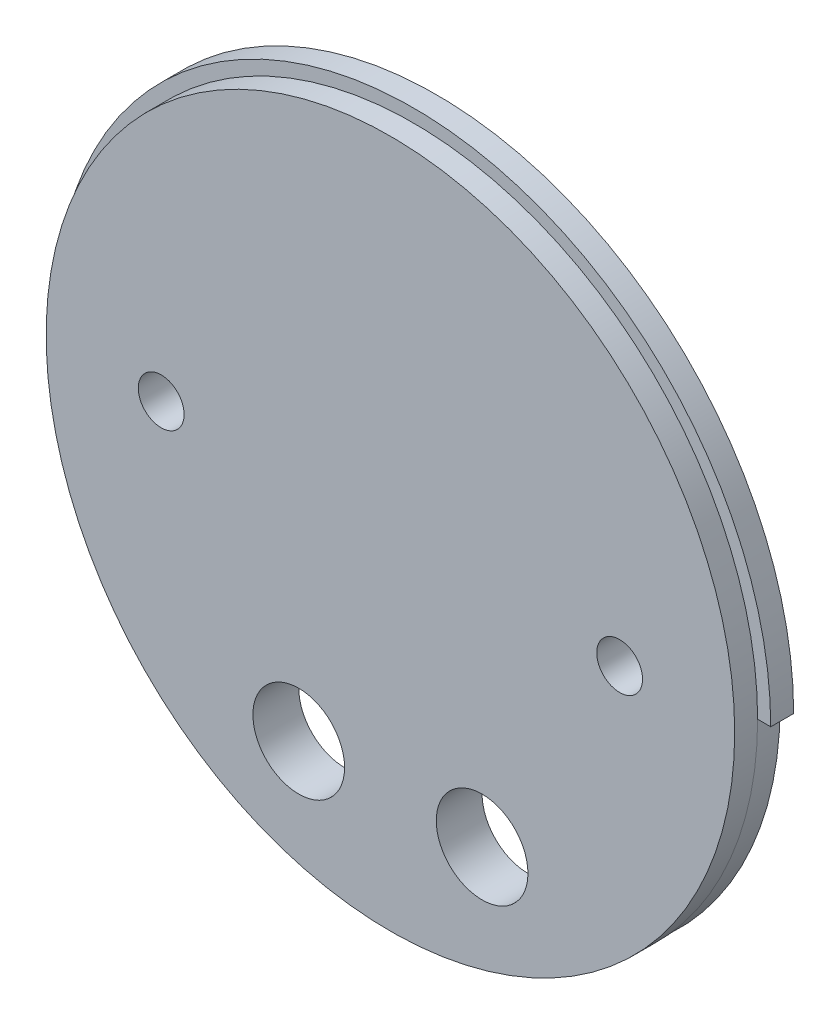
ISO-10303-21;
HEADER;
FILE_DESCRIPTION(('STEP AP214'),'2;1');
FILE_NAME('part.step','',(''),(''),'','','');
FILE_SCHEMA(('AUTOMOTIVE_DESIGN { 1 0 10303 214 1 1 1 1 }'));
ENDSEC;
DATA;
#1=APPLICATION_CONTEXT('core data for automotive mechanical design processes');
#2=APPLICATION_PROTOCOL_DEFINITION('international standard','automotive_design',2000,#1);
#3=PRODUCT_CONTEXT('',#1,'mechanical');
#4=PRODUCT('Part','Part','',(#3));
#5=PRODUCT_RELATED_PRODUCT_CATEGORY('part','',(#4));
#6=PRODUCT_DEFINITION_FORMATION('','',#4);
#7=PRODUCT_DEFINITION_CONTEXT('part definition',#1,'design');
#8=PRODUCT_DEFINITION('design','',#6,#7);
#9=PRODUCT_DEFINITION_SHAPE('','',#8);
#10=(LENGTH_UNIT() NAMED_UNIT(*) SI_UNIT(.MILLI.,.METRE.));
#11=(NAMED_UNIT(*) PLANE_ANGLE_UNIT() SI_UNIT($,.RADIAN.));
#12=(NAMED_UNIT(*) SI_UNIT($,.STERADIAN.) SOLID_ANGLE_UNIT());
#13=UNCERTAINTY_MEASURE_WITH_UNIT(LENGTH_MEASURE(1.E-05),#10,'distance_accuracy_value','');
#14=(GEOMETRIC_REPRESENTATION_CONTEXT(3) GLOBAL_UNCERTAINTY_ASSIGNED_CONTEXT((#13)) GLOBAL_UNIT_ASSIGNED_CONTEXT((#10,
#11,#12)) REPRESENTATION_CONTEXT('',''));
#15=CARTESIAN_POINT('',(0.,0.,0.));
#16=DIRECTION('',(0.,0.,1.));
#17=DIRECTION('',(1.,0.,0.));
#18=AXIS2_PLACEMENT_3D('',#15,#16,#17);
#19=CARTESIAN_POINT('',(0.,0.,3.175));
#20=DIRECTION('',(0.,0.,-1.));
#21=DIRECTION('',(-1.,0.,0.));
#22=AXIS2_PLACEMENT_3D('',#19,#20,#21);
#23=CYLINDRICAL_SURFACE('',#22,49.5046);
#24=CARTESIAN_POINT('',(0.,0.,3.175));
#25=DIRECTION('',(0.,0.,1.));
#26=DIRECTION('',(1.,0.,0.));
#27=AXIS2_PLACEMENT_3D('',#24,#25,#26);
#28=CIRCLE('',#27,49.5046);
#29=CARTESIAN_POINT('',(49.5046,0.,3.175));
#30=VERTEX_POINT('',#29);
#31=CARTESIAN_POINT('',(-49.5046,0.,3.175));
#32=VERTEX_POINT('',#31);
#33=EDGE_CURVE('E146',#30,#32,#28,.T.);
#34=ORIENTED_EDGE('',*,*,#33,.F.);
#35=DIRECTION('',(0.,0.,-1.));
#36=VECTOR('',#35,1.);
#37=CARTESIAN_POINT('',(49.5046,0.,3.175));
#38=LINE('',#37,#36);
#39=CARTESIAN_POINT('',(49.5046,0.,0.));
#40=VERTEX_POINT('',#39);
#41=EDGE_CURVE('E113',#30,#40,#38,.T.);
#42=ORIENTED_EDGE('',*,*,#41,.T.);
#43=CARTESIAN_POINT('',(0.,0.,0.));
#44=DIRECTION('',(0.,0.,1.));
#45=DIRECTION('',(1.,0.,0.));
#46=AXIS2_PLACEMENT_3D('',#43,#44,#45);
#47=CIRCLE('',#46,49.5046);
#48=CARTESIAN_POINT('',(-49.5046,0.,0.));
#49=VERTEX_POINT('',#48);
#50=EDGE_CURVE('E142',#40,#49,#47,.T.);
#51=ORIENTED_EDGE('',*,*,#50,.T.);
#52=DIRECTION('',(0.,0.,-1.));
#53=VECTOR('',#52,1.);
#54=CARTESIAN_POINT('',(-49.5046,0.,3.175));
#55=LINE('',#54,#53);
#56=EDGE_CURVE('E97',#49,#32,#55,.F.);
#57=ORIENTED_EDGE('',*,*,#56,.T.);
#58=EDGE_LOOP('',(#34,#42,#51,#57));
#59=FACE_BOUND('',#58,.T.);
#60=ADVANCED_FACE('F37',(#59),#23,.T.);
#61=CARTESIAN_POINT('',(0.,0.,3.175));
#62=DIRECTION('',(0.,0.,1.));
#63=DIRECTION('',(1.,0.,0.));
#64=AXIS2_PLACEMENT_3D('',#61,#62,#63);
#65=PLANE('',#64);
#66=DIRECTION('',(-1.,0.,0.));
#67=VECTOR('',#66,1.);
#68=CARTESIAN_POINT('',(47.625,0.,3.175));
#69=LINE('',#68,#67);
#70=CARTESIAN_POINT('',(47.6885,0.,3.175));
#71=VERTEX_POINT('',#70);
#72=EDGE_CURVE('E51',#30,#71,#69,.T.);
#73=ORIENTED_EDGE('',*,*,#72,.F.);
#74=ORIENTED_EDGE('',*,*,#33,.T.);
#75=DIRECTION('',(-1.,0.,0.));
#76=VECTOR('',#75,1.);
#77=CARTESIAN_POINT('',(-50.165,0.,3.175));
#78=LINE('',#77,#76);
#79=CARTESIAN_POINT('',(-47.6885,0.,3.175));
#80=VERTEX_POINT('',#79);
#81=EDGE_CURVE('E108',#80,#32,#78,.T.);
#82=ORIENTED_EDGE('',*,*,#81,.F.);
#83=CARTESIAN_POINT('',(0.,0.,3.175));
#84=DIRECTION('',(0.,0.,1.));
#85=DIRECTION('',(1.,0.,0.));
#86=AXIS2_PLACEMENT_3D('',#83,#84,#85);
#87=CIRCLE('',#86,47.6885);
#88=EDGE_CURVE('E44',#71,#80,#87,.T.);
#89=ORIENTED_EDGE('',*,*,#88,.F.);
#90=EDGE_LOOP('',(#73,#74,#82,#89));
#91=FACE_BOUND('',#90,.T.);
#92=ADVANCED_FACE('F153',(#91),#65,.T.);
#93=CARTESIAN_POINT('',(0.,0.,0.));
#94=DIRECTION('',(0.,0.,1.));
#95=DIRECTION('',(1.,0.,0.));
#96=AXIS2_PLACEMENT_3D('',#93,#94,#95);
#97=PLANE('',#96);
#98=CARTESIAN_POINT('',(-31.75,0.,0.));
#99=DIRECTION('',(0.,0.,1.));
#100=DIRECTION('',(1.,0.,0.));
#101=AXIS2_PLACEMENT_3D('',#98,#99,#100);
#102=CIRCLE('',#101,3.17500000000001);
#103=CARTESIAN_POINT('',(-28.575,0.,0.));
#104=VERTEX_POINT('',#103);
#105=EDGE_CURVE('E116',#104,#104,#102,.T.);
#106=ORIENTED_EDGE('',*,*,#105,.T.);
#107=EDGE_LOOP('',(#106));
#108=FACE_BOUND('',#107,.T.);
#109=CARTESIAN_POINT('',(12.7,-31.2353524431853,0.));
#110=DIRECTION('',(0.,0.,1.));
#111=DIRECTION('',(1.,0.,0.));
#112=AXIS2_PLACEMENT_3D('',#109,#110,#111);
#113=CIRCLE('',#112,6.35);
#114=CARTESIAN_POINT('',(19.05,-31.2353524431853,0.));
#115=VERTEX_POINT('',#114);
#116=EDGE_CURVE('E124',#115,#115,#113,.T.);
#117=ORIENTED_EDGE('',*,*,#116,.T.);
#118=EDGE_LOOP('',(#117));
#119=FACE_BOUND('',#118,.T.);
#120=CARTESIAN_POINT('',(-12.7,-31.2353524431853,0.));
#121=DIRECTION('',(0.,0.,1.));
#122=DIRECTION('',(1.,0.,0.));
#123=AXIS2_PLACEMENT_3D('',#120,#121,#122);
#124=CIRCLE('',#123,6.35);
#125=CARTESIAN_POINT('',(-6.35,-31.2353524431853,0.));
#126=VERTEX_POINT('',#125);
#127=EDGE_CURVE('E135',#126,#126,#124,.T.);
#128=ORIENTED_EDGE('',*,*,#127,.T.);
#129=EDGE_LOOP('',(#128));
#130=FACE_BOUND('',#129,.T.);
#131=CARTESIAN_POINT('',(31.75,0.,0.));
#132=DIRECTION('',(0.,0.,1.));
#133=DIRECTION('',(1.,0.,0.));
#134=AXIS2_PLACEMENT_3D('',#131,#132,#133);
#135=CIRCLE('',#134,3.17500000000001);
#136=CARTESIAN_POINT('',(34.925,0.,0.));
#137=VERTEX_POINT('',#136);
#138=EDGE_CURVE('E123',#137,#137,#135,.T.);
#139=ORIENTED_EDGE('',*,*,#138,.T.);
#140=EDGE_LOOP('',(#139));
#141=FACE_BOUND('',#140,.T.);
#142=ORIENTED_EDGE('',*,*,#50,.F.);
#143=DIRECTION('',(-1.,0.,0.));
#144=VECTOR('',#143,1.);
#145=CARTESIAN_POINT('',(0.,0.,0.));
#146=LINE('',#145,#144);
#147=CARTESIAN_POINT('',(47.625,0.,0.));
#148=VERTEX_POINT('',#147);
#149=EDGE_CURVE('E11',#40,#148,#146,.T.);
#150=ORIENTED_EDGE('',*,*,#149,.T.);
#151=CARTESIAN_POINT('',(0.,0.,0.));
#152=DIRECTION('',(0.,0.,-1.));
#153=DIRECTION('',(1.,0.,0.));
#154=AXIS2_PLACEMENT_3D('',#151,#152,#153);
#155=CIRCLE('',#154,47.625);
#156=CARTESIAN_POINT('',(-47.625,0.,0.));
#157=VERTEX_POINT('',#156);
#158=EDGE_CURVE('E85',#148,#157,#155,.T.);
#159=ORIENTED_EDGE('',*,*,#158,.T.);
#160=DIRECTION('',(-1.,0.,0.));
#161=VECTOR('',#160,1.);
#162=CARTESIAN_POINT('',(-50.165,0.,0.));
#163=LINE('',#162,#161);
#164=EDGE_CURVE('E92',#157,#49,#163,.T.);
#165=ORIENTED_EDGE('',*,*,#164,.T.);
#166=EDGE_LOOP('',(#142,#150,#159,#165));
#167=FACE_BOUND('',#166,.T.);
#168=ADVANCED_FACE('F102',(#108,#119,#130,#141,#167),#97,.F.);
#169=CARTESIAN_POINT('',(0.,0.,6.35));
#170=DIRECTION('',(0.,0.,-1.));
#171=DIRECTION('',(-1.,0.,0.));
#172=AXIS2_PLACEMENT_3D('',#169,#170,#171);
#173=CYLINDRICAL_SURFACE('',#172,47.6885);
#174=CARTESIAN_POINT('',(0.,0.,6.35));
#175=DIRECTION('',(0.,0.,1.));
#176=DIRECTION('',(1.,0.,0.));
#177=AXIS2_PLACEMENT_3D('',#174,#175,#176);
#178=CIRCLE('',#177,47.6885);
#179=CARTESIAN_POINT('',(47.6885,0.,6.35));
#180=VERTEX_POINT('',#179);
#181=EDGE_CURVE('E119',#180,#180,#178,.T.);
#182=ORIENTED_EDGE('',*,*,#181,.F.);
#183=EDGE_LOOP('',(#182));
#184=FACE_BOUND('',#183,.T.);
#185=ORIENTED_EDGE('',*,*,#88,.T.);
#186=EDGE_CURVE('E145',#80,#71,#87,.T.);
#187=ORIENTED_EDGE('',*,*,#186,.T.);
#188=EDGE_LOOP('',(#185,#187));
#189=FACE_BOUND('',#188,.T.);
#190=ADVANCED_FACE('F157',(#184,#189),#173,.T.);
#191=CARTESIAN_POINT('',(0.,0.,6.35));
#192=DIRECTION('',(0.,0.,1.));
#193=DIRECTION('',(1.,0.,0.));
#194=AXIS2_PLACEMENT_3D('',#191,#192,#193);
#195=PLANE('',#194);
#196=CARTESIAN_POINT('',(-31.75,0.,6.35));
#197=DIRECTION('',(0.,0.,1.));
#198=DIRECTION('',(1.,0.,0.));
#199=AXIS2_PLACEMENT_3D('',#196,#197,#198);
#200=CIRCLE('',#199,3.17500000000001);
#201=CARTESIAN_POINT('',(-28.575,0.,6.35));
#202=VERTEX_POINT('',#201);
#203=EDGE_CURVE('E120',#202,#202,#200,.T.);
#204=ORIENTED_EDGE('',*,*,#203,.F.);
#205=EDGE_LOOP('',(#204));
#206=FACE_BOUND('',#205,.T.);
#207=CARTESIAN_POINT('',(12.7,-31.2353524431853,6.35));
#208=DIRECTION('',(0.,0.,1.));
#209=DIRECTION('',(1.,0.,0.));
#210=AXIS2_PLACEMENT_3D('',#207,#208,#209);
#211=CIRCLE('',#210,6.35);
#212=CARTESIAN_POINT('',(19.05,-31.2353524431853,6.35));
#213=VERTEX_POINT('',#212);
#214=EDGE_CURVE('E115',#213,#213,#211,.T.);
#215=ORIENTED_EDGE('',*,*,#214,.F.);
#216=EDGE_LOOP('',(#215));
#217=FACE_BOUND('',#216,.T.);
#218=CARTESIAN_POINT('',(-12.7,-31.2353524431853,6.35));
#219=DIRECTION('',(0.,0.,1.));
#220=DIRECTION('',(1.,0.,0.));
#221=AXIS2_PLACEMENT_3D('',#218,#219,#220);
#222=CIRCLE('',#221,6.35);
#223=CARTESIAN_POINT('',(-6.35,-31.2353524431853,6.35));
#224=VERTEX_POINT('',#223);
#225=EDGE_CURVE('E127',#224,#224,#222,.T.);
#226=ORIENTED_EDGE('',*,*,#225,.F.);
#227=EDGE_LOOP('',(#226));
#228=FACE_BOUND('',#227,.T.);
#229=CARTESIAN_POINT('',(31.75,0.,6.35));
#230=DIRECTION('',(0.,0.,1.));
#231=DIRECTION('',(1.,0.,0.));
#232=AXIS2_PLACEMENT_3D('',#229,#230,#231);
#233=CIRCLE('',#232,3.17500000000001);
#234=CARTESIAN_POINT('',(34.925,0.,6.35));
#235=VERTEX_POINT('',#234);
#236=EDGE_CURVE('E132',#235,#235,#233,.T.);
#237=ORIENTED_EDGE('',*,*,#236,.F.);
#238=EDGE_LOOP('',(#237));
#239=FACE_BOUND('',#238,.T.);
#240=ORIENTED_EDGE('',*,*,#181,.T.);
#241=EDGE_LOOP('',(#240));
#242=FACE_BOUND('',#241,.T.);
#243=ADVANCED_FACE('F181',(#206,#217,#228,#239,#242),#195,.T.);
#244=CARTESIAN_POINT('',(31.75,0.,0.));
#245=DIRECTION('',(0.,0.,1.));
#246=DIRECTION('',(1.,0.,0.));
#247=AXIS2_PLACEMENT_3D('',#244,#245,#246);
#248=CYLINDRICAL_SURFACE('',#247,3.17500000000001);
#249=ORIENTED_EDGE('',*,*,#138,.F.);
#250=EDGE_LOOP('',(#249));
#251=FACE_BOUND('',#250,.T.);
#252=ORIENTED_EDGE('',*,*,#236,.T.);
#253=EDGE_LOOP('',(#252));
#254=FACE_BOUND('',#253,.T.);
#255=ADVANCED_FACE('F185',(#251,#254),#248,.F.);
#256=CARTESIAN_POINT('',(-12.7,-31.2353524431853,0.));
#257=DIRECTION('',(0.,0.,1.));
#258=DIRECTION('',(1.,0.,0.));
#259=AXIS2_PLACEMENT_3D('',#256,#257,#258);
#260=CYLINDRICAL_SURFACE('',#259,6.35);
#261=ORIENTED_EDGE('',*,*,#127,.F.);
#262=EDGE_LOOP('',(#261));
#263=FACE_BOUND('',#262,.T.);
#264=ORIENTED_EDGE('',*,*,#225,.T.);
#265=EDGE_LOOP('',(#264));
#266=FACE_BOUND('',#265,.T.);
#267=ADVANCED_FACE('F187',(#263,#266),#260,.F.);
#268=CARTESIAN_POINT('',(12.7,-31.2353524431853,0.));
#269=DIRECTION('',(0.,0.,1.));
#270=DIRECTION('',(1.,0.,0.));
#271=AXIS2_PLACEMENT_3D('',#268,#269,#270);
#272=CYLINDRICAL_SURFACE('',#271,6.35);
#273=ORIENTED_EDGE('',*,*,#116,.F.);
#274=EDGE_LOOP('',(#273));
#275=FACE_BOUND('',#274,.T.);
#276=ORIENTED_EDGE('',*,*,#214,.T.);
#277=EDGE_LOOP('',(#276));
#278=FACE_BOUND('',#277,.T.);
#279=ADVANCED_FACE('F190',(#275,#278),#272,.F.);
#280=CARTESIAN_POINT('',(-31.75,0.,0.));
#281=DIRECTION('',(0.,0.,1.));
#282=DIRECTION('',(1.,0.,0.));
#283=AXIS2_PLACEMENT_3D('',#280,#281,#282);
#284=CYLINDRICAL_SURFACE('',#283,3.17500000000001);
#285=ORIENTED_EDGE('',*,*,#105,.F.);
#286=EDGE_LOOP('',(#285));
#287=FACE_BOUND('',#286,.T.);
#288=ORIENTED_EDGE('',*,*,#203,.T.);
#289=EDGE_LOOP('',(#288));
#290=FACE_BOUND('',#289,.T.);
#291=ADVANCED_FACE('F197',(#287,#290),#284,.F.);
#292=CARTESIAN_POINT('',(47.625,0.,0.));
#293=DIRECTION('',(0.,1.,0.));
#294=DIRECTION('',(0.,0.,1.));
#295=AXIS2_PLACEMENT_3D('',#292,#293,#294);
#296=PLANE('',#295);
#297=ORIENTED_EDGE('',*,*,#72,.T.);
#298=CARTESIAN_POINT('',(47.625,0.,3.175));
#299=VERTEX_POINT('',#298);
#300=EDGE_CURVE('E104',#71,#299,#69,.T.);
#301=ORIENTED_EDGE('',*,*,#300,.T.);
#302=DIRECTION('',(0.,0.,1.));
#303=VECTOR('',#302,1.);
#304=CARTESIAN_POINT('',(47.625,0.,0.));
#305=LINE('',#304,#303);
#306=EDGE_CURVE('E91',#148,#299,#305,.T.);
#307=ORIENTED_EDGE('',*,*,#306,.F.);
#308=ORIENTED_EDGE('',*,*,#149,.F.);
#309=ORIENTED_EDGE('',*,*,#41,.F.);
#310=EDGE_LOOP('',(#297,#301,#307,#308,#309));
#311=FACE_BOUND('',#310,.T.);
#312=ADVANCED_FACE('F150',(#311),#296,.F.);
#313=CARTESIAN_POINT('',(-50.165,0.,0.));
#314=DIRECTION('',(0.,1.,0.));
#315=DIRECTION('',(0.,0.,1.));
#316=AXIS2_PLACEMENT_3D('',#313,#314,#315);
#317=PLANE('',#316);
#318=ORIENTED_EDGE('',*,*,#164,.F.);
#319=DIRECTION('',(0.,0.,1.));
#320=VECTOR('',#319,1.);
#321=CARTESIAN_POINT('',(-47.625,0.,0.));
#322=LINE('',#321,#320);
#323=CARTESIAN_POINT('',(-47.625,0.,3.175));
#324=VERTEX_POINT('',#323);
#325=EDGE_CURVE('E80',#157,#324,#322,.T.);
#326=ORIENTED_EDGE('',*,*,#325,.T.);
#327=EDGE_CURVE('E109',#324,#80,#78,.T.);
#328=ORIENTED_EDGE('',*,*,#327,.T.);
#329=ORIENTED_EDGE('',*,*,#81,.T.);
#330=ORIENTED_EDGE('',*,*,#56,.F.);
#331=EDGE_LOOP('',(#318,#326,#328,#329,#330));
#332=FACE_BOUND('',#331,.T.);
#333=ADVANCED_FACE('F95',(#332),#317,.F.);
#334=CARTESIAN_POINT('',(0.,0.,3.175));
#335=DIRECTION('',(0.,0.,1.));
#336=DIRECTION('',(1.,0.,0.));
#337=AXIS2_PLACEMENT_3D('',#334,#335,#336);
#338=PLANE('',#337);
#339=ORIENTED_EDGE('',*,*,#327,.F.);
#340=CARTESIAN_POINT('',(0.,0.,3.175));
#341=DIRECTION('',(0.,0.,-1.));
#342=DIRECTION('',(1.,0.,0.));
#343=AXIS2_PLACEMENT_3D('',#340,#341,#342);
#344=CIRCLE('',#343,47.625);
#345=EDGE_CURVE('E87',#299,#324,#344,.T.);
#346=ORIENTED_EDGE('',*,*,#345,.F.);
#347=ORIENTED_EDGE('',*,*,#300,.F.);
#348=ORIENTED_EDGE('',*,*,#186,.F.);
#349=EDGE_LOOP('',(#339,#346,#347,#348));
#350=FACE_BOUND('',#349,.T.);
#351=ADVANCED_FACE('F159',(#350),#338,.F.);
#352=CARTESIAN_POINT('',(0.,0.,0.));
#353=DIRECTION('',(0.,0.,1.));
#354=DIRECTION('',(1.,0.,0.));
#355=AXIS2_PLACEMENT_3D('',#352,#353,#354);
#356=CYLINDRICAL_SURFACE('',#355,47.625);
#357=ORIENTED_EDGE('',*,*,#345,.T.);
#358=ORIENTED_EDGE('',*,*,#325,.F.);
#359=ORIENTED_EDGE('',*,*,#158,.F.);
#360=ORIENTED_EDGE('',*,*,#306,.T.);
#361=EDGE_LOOP('',(#357,#358,#359,#360));
#362=FACE_BOUND('',#361,.T.);
#363=ADVANCED_FACE('F82',(#362),#356,.T.);
#364=CLOSED_SHELL('',(#60,#92,#168,#190,#243,#255,#267,#279,#291,#312,#333,#351,#363));
#365=MANIFOLD_SOLID_BREP('B2',#364);
#366=ADVANCED_BREP_SHAPE_REPRESENTATION('',(#18,#365),#14);
#367=SHAPE_DEFINITION_REPRESENTATION(#9,#366);
ENDSEC;
END-ISO-10303-21;
